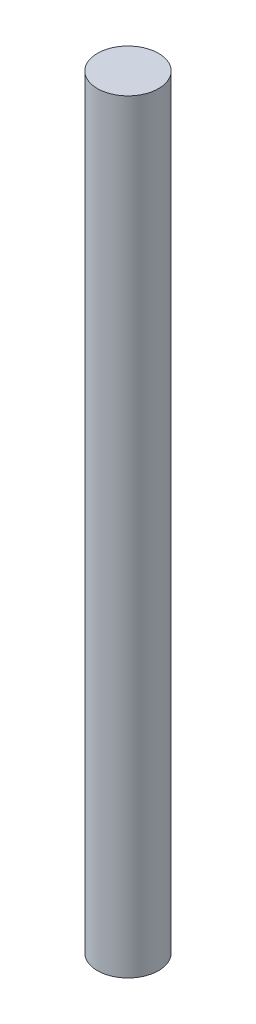
ISO-10303-21;
HEADER;
FILE_DESCRIPTION(('STEP AP214'),'2;1');
FILE_NAME('part.step','',(''),(''),'','','');
FILE_SCHEMA(('AUTOMOTIVE_DESIGN { 1 0 10303 214 1 1 1 1 }'));
ENDSEC;
DATA;
#1=APPLICATION_CONTEXT('core data for automotive mechanical design processes');
#2=APPLICATION_PROTOCOL_DEFINITION('international standard','automotive_design',2000,#1);
#3=PRODUCT_CONTEXT('',#1,'mechanical');
#4=PRODUCT('Part','Part','',(#3));
#5=PRODUCT_RELATED_PRODUCT_CATEGORY('part','',(#4));
#6=PRODUCT_DEFINITION_FORMATION('','',#4);
#7=PRODUCT_DEFINITION_CONTEXT('part definition',#1,'design');
#8=PRODUCT_DEFINITION('design','',#6,#7);
#9=PRODUCT_DEFINITION_SHAPE('','',#8);
#10=(LENGTH_UNIT() NAMED_UNIT(*) SI_UNIT(.MILLI.,.METRE.));
#11=(NAMED_UNIT(*) PLANE_ANGLE_UNIT() SI_UNIT($,.RADIAN.));
#12=(NAMED_UNIT(*) SI_UNIT($,.STERADIAN.) SOLID_ANGLE_UNIT());
#13=UNCERTAINTY_MEASURE_WITH_UNIT(LENGTH_MEASURE(1.E-05),#10,'distance_accuracy_value','');
#14=(GEOMETRIC_REPRESENTATION_CONTEXT(3) GLOBAL_UNCERTAINTY_ASSIGNED_CONTEXT((#13)) GLOBAL_UNIT_ASSIGNED_CONTEXT((#10,
#11,#12)) REPRESENTATION_CONTEXT('',''));
#15=CARTESIAN_POINT('',(0.,0.,0.));
#16=DIRECTION('',(0.,0.,1.));
#17=DIRECTION('',(1.,0.,0.));
#18=AXIS2_PLACEMENT_3D('',#15,#16,#17);
#19=CARTESIAN_POINT('',(0.,75.,0.));
#20=DIRECTION('',(0.,-1.,0.));
#21=DIRECTION('',(0.,0.,-1.));
#22=AXIS2_PLACEMENT_3D('',#19,#20,#21);
#23=CYLINDRICAL_SURFACE('',#22,3.);
#24=CARTESIAN_POINT('',(0.,75.,0.));
#25=DIRECTION('',(0.,1.,0.));
#26=DIRECTION('',(0.,0.,1.));
#27=AXIS2_PLACEMENT_3D('',#24,#25,#26);
#28=CIRCLE('',#27,3.);
#29=CARTESIAN_POINT('',(0.,75.,3.));
#30=VERTEX_POINT('',#29);
#31=EDGE_CURVE('E10',#30,#30,#28,.T.);
#32=ORIENTED_EDGE('',*,*,#31,.F.);
#33=EDGE_LOOP('',(#32));
#34=FACE_BOUND('',#33,.T.);
#35=CARTESIAN_POINT('',(0.,0.,0.));
#36=DIRECTION('',(0.,1.,0.));
#37=DIRECTION('',(0.,0.,1.));
#38=AXIS2_PLACEMENT_3D('',#35,#36,#37);
#39=CIRCLE('',#38,3.);
#40=CARTESIAN_POINT('',(0.,0.,3.));
#41=VERTEX_POINT('',#40);
#42=EDGE_CURVE('E32',#41,#41,#39,.T.);
#43=ORIENTED_EDGE('',*,*,#42,.T.);
#44=EDGE_LOOP('',(#43));
#45=FACE_BOUND('',#44,.T.);
#46=ADVANCED_FACE('F29',(#34,#45),#23,.T.);
#47=CARTESIAN_POINT('',(0.,75.,0.));
#48=DIRECTION('',(0.,1.,0.));
#49=DIRECTION('',(0.,0.,1.));
#50=AXIS2_PLACEMENT_3D('',#47,#48,#49);
#51=PLANE('',#50);
#52=ORIENTED_EDGE('',*,*,#31,.T.);
#53=EDGE_LOOP('',(#52));
#54=FACE_BOUND('',#53,.T.);
#55=ADVANCED_FACE('F44',(#54),#51,.T.);
#56=CARTESIAN_POINT('',(0.,0.,0.));
#57=DIRECTION('',(0.,1.,0.));
#58=DIRECTION('',(0.,0.,1.));
#59=AXIS2_PLACEMENT_3D('',#56,#57,#58);
#60=PLANE('',#59);
#61=ORIENTED_EDGE('',*,*,#42,.F.);
#62=EDGE_LOOP('',(#61));
#63=FACE_BOUND('',#62,.T.);
#64=ADVANCED_FACE('F42',(#63),#60,.F.);
#65=CLOSED_SHELL('',(#46,#55,#64));
#66=MANIFOLD_SOLID_BREP('B2',#65);
#67=ADVANCED_BREP_SHAPE_REPRESENTATION('',(#18,#66),#14);
#68=SHAPE_DEFINITION_REPRESENTATION(#9,#67);
ENDSEC;
END-ISO-10303-21;
